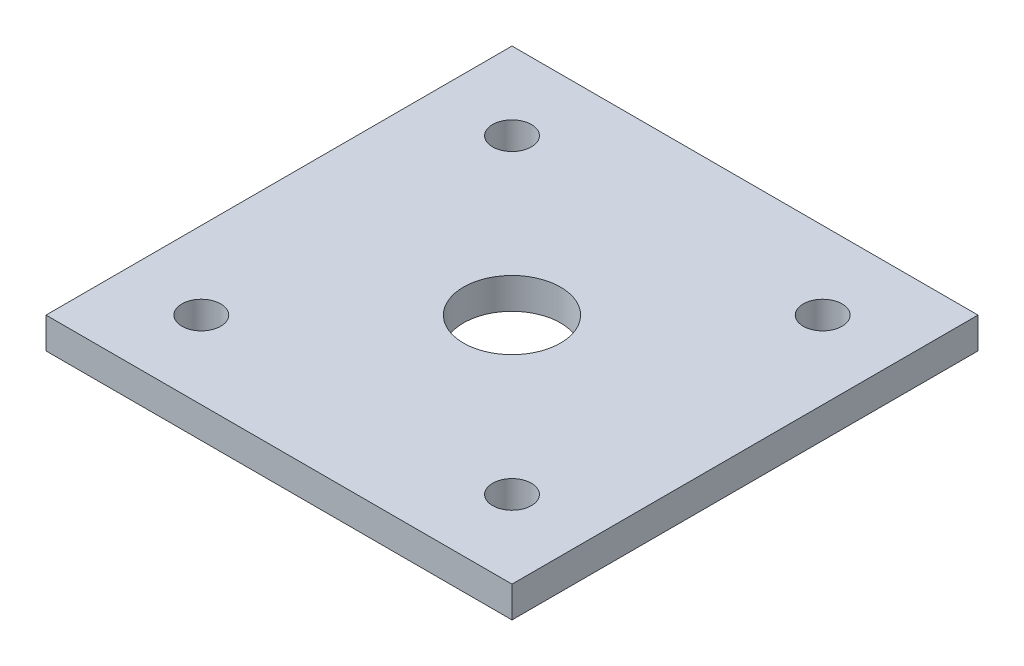
ISO-10303-21;
HEADER;
FILE_DESCRIPTION(('STEP AP214'),'2;1');
FILE_NAME('part.step','',(''),(''),'','','');
FILE_SCHEMA(('AUTOMOTIVE_DESIGN { 1 0 10303 214 1 1 1 1 }'));
ENDSEC;
DATA;
#1=APPLICATION_CONTEXT('core data for automotive mechanical design processes');
#2=APPLICATION_PROTOCOL_DEFINITION('international standard','automotive_design',2000,#1);
#3=PRODUCT_CONTEXT('',#1,'mechanical');
#4=PRODUCT('Part','Part','',(#3));
#5=PRODUCT_RELATED_PRODUCT_CATEGORY('part','',(#4));
#6=PRODUCT_DEFINITION_FORMATION('','',#4);
#7=PRODUCT_DEFINITION_CONTEXT('part definition',#1,'design');
#8=PRODUCT_DEFINITION('design','',#6,#7);
#9=PRODUCT_DEFINITION_SHAPE('','',#8);
#10=(LENGTH_UNIT() NAMED_UNIT(*) SI_UNIT(.MILLI.,.METRE.));
#11=(NAMED_UNIT(*) PLANE_ANGLE_UNIT() SI_UNIT($,.RADIAN.));
#12=(NAMED_UNIT(*) SI_UNIT($,.STERADIAN.) SOLID_ANGLE_UNIT());
#13=UNCERTAINTY_MEASURE_WITH_UNIT(LENGTH_MEASURE(1.E-05),#10,'distance_accuracy_value','');
#14=(GEOMETRIC_REPRESENTATION_CONTEXT(3) GLOBAL_UNCERTAINTY_ASSIGNED_CONTEXT((#13)) GLOBAL_UNIT_ASSIGNED_CONTEXT((#10,
#11,#12)) REPRESENTATION_CONTEXT('',''));
#15=CARTESIAN_POINT('',(0.,0.,0.));
#16=DIRECTION('',(0.,0.,1.));
#17=DIRECTION('',(1.,0.,0.));
#18=AXIS2_PLACEMENT_3D('',#15,#16,#17);
#19=CARTESIAN_POINT('',(60.,8.,-60.));
#20=DIRECTION('',(-1.,0.,0.));
#21=DIRECTION('',(0.,0.,1.));
#22=AXIS2_PLACEMENT_3D('',#19,#20,#21);
#23=PLANE('',#22);
#24=DIRECTION('',(0.,0.,-1.));
#25=VECTOR('',#24,1.);
#26=CARTESIAN_POINT('',(60.,0.,-60.));
#27=LINE('',#26,#25);
#28=CARTESIAN_POINT('',(60.,0.,60.));
#29=VERTEX_POINT('',#28);
#30=CARTESIAN_POINT('',(60.,0.,-60.));
#31=VERTEX_POINT('',#30);
#32=EDGE_CURVE('E111',#29,#31,#27,.T.);
#33=ORIENTED_EDGE('',*,*,#32,.T.);
#34=DIRECTION('',(0.,-1.,0.));
#35=VECTOR('',#34,1.);
#36=CARTESIAN_POINT('',(60.,8.,-60.));
#37=LINE('',#36,#35);
#38=CARTESIAN_POINT('',(60.,8.,-60.));
#39=VERTEX_POINT('',#38);
#40=EDGE_CURVE('E11',#39,#31,#37,.T.);
#41=ORIENTED_EDGE('',*,*,#40,.F.);
#42=DIRECTION('',(0.,0.,-1.));
#43=VECTOR('',#42,1.);
#44=CARTESIAN_POINT('',(60.,8.,-60.));
#45=LINE('',#44,#43);
#46=CARTESIAN_POINT('',(60.,8.,60.));
#47=VERTEX_POINT('',#46);
#48=EDGE_CURVE('E94',#47,#39,#45,.T.);
#49=ORIENTED_EDGE('',*,*,#48,.F.);
#50=DIRECTION('',(0.,-1.,0.));
#51=VECTOR('',#50,1.);
#52=CARTESIAN_POINT('',(60.,8.,60.));
#53=LINE('',#52,#51);
#54=EDGE_CURVE('E107',#47,#29,#53,.T.);
#55=ORIENTED_EDGE('',*,*,#54,.T.);
#56=EDGE_LOOP('',(#33,#41,#49,#55));
#57=FACE_BOUND('',#56,.T.);
#58=ADVANCED_FACE('F40',(#57),#23,.F.);
#59=CARTESIAN_POINT('',(-60.,8.,-60.));
#60=DIRECTION('',(0.,0.,1.));
#61=DIRECTION('',(1.,0.,0.));
#62=AXIS2_PLACEMENT_3D('',#59,#60,#61);
#63=PLANE('',#62);
#64=DIRECTION('',(-1.,0.,0.));
#65=VECTOR('',#64,1.);
#66=CARTESIAN_POINT('',(-60.,0.,-60.));
#67=LINE('',#66,#65);
#68=CARTESIAN_POINT('',(-60.,0.,-60.));
#69=VERTEX_POINT('',#68);
#70=EDGE_CURVE('E99',#31,#69,#67,.T.);
#71=ORIENTED_EDGE('',*,*,#70,.T.);
#72=DIRECTION('',(0.,-1.,0.));
#73=VECTOR('',#72,1.);
#74=CARTESIAN_POINT('',(-60.,8.,-60.));
#75=LINE('',#74,#73);
#76=CARTESIAN_POINT('',(-60.,8.,-60.));
#77=VERTEX_POINT('',#76);
#78=EDGE_CURVE('E50',#77,#69,#75,.T.);
#79=ORIENTED_EDGE('',*,*,#78,.F.);
#80=DIRECTION('',(-1.,0.,0.));
#81=VECTOR('',#80,1.);
#82=CARTESIAN_POINT('',(-60.,8.,-60.));
#83=LINE('',#82,#81);
#84=EDGE_CURVE('E89',#39,#77,#83,.T.);
#85=ORIENTED_EDGE('',*,*,#84,.F.);
#86=ORIENTED_EDGE('',*,*,#40,.T.);
#87=EDGE_LOOP('',(#71,#79,#85,#86));
#88=FACE_BOUND('',#87,.T.);
#89=ADVANCED_FACE('F98',(#88),#63,.F.);
#90=CARTESIAN_POINT('',(-60.,8.,-60.));
#91=DIRECTION('',(1.,0.,0.));
#92=DIRECTION('',(0.,0.,-1.));
#93=AXIS2_PLACEMENT_3D('',#90,#91,#92);
#94=PLANE('',#93);
#95=DIRECTION('',(0.,0.,1.));
#96=VECTOR('',#95,1.);
#97=CARTESIAN_POINT('',(-60.,0.,-60.));
#98=LINE('',#97,#96);
#99=CARTESIAN_POINT('',(-60.,0.,60.));
#100=VERTEX_POINT('',#99);
#101=EDGE_CURVE('E76',#69,#100,#98,.T.);
#102=ORIENTED_EDGE('',*,*,#101,.T.);
#103=DIRECTION('',(0.,-1.,0.));
#104=VECTOR('',#103,1.);
#105=CARTESIAN_POINT('',(-60.,8.,60.));
#106=LINE('',#105,#104);
#107=CARTESIAN_POINT('',(-60.,8.,60.));
#108=VERTEX_POINT('',#107);
#109=EDGE_CURVE('E101',#108,#100,#106,.T.);
#110=ORIENTED_EDGE('',*,*,#109,.F.);
#111=DIRECTION('',(0.,0.,1.));
#112=VECTOR('',#111,1.);
#113=CARTESIAN_POINT('',(-60.,8.,-60.));
#114=LINE('',#113,#112);
#115=EDGE_CURVE('E92',#77,#108,#114,.T.);
#116=ORIENTED_EDGE('',*,*,#115,.F.);
#117=ORIENTED_EDGE('',*,*,#78,.T.);
#118=EDGE_LOOP('',(#102,#110,#116,#117));
#119=FACE_BOUND('',#118,.T.);
#120=ADVANCED_FACE('F103',(#119),#94,.F.);
#121=CARTESIAN_POINT('',(-60.,8.,60.));
#122=DIRECTION('',(0.,0.,-1.));
#123=DIRECTION('',(-1.,0.,0.));
#124=AXIS2_PLACEMENT_3D('',#121,#122,#123);
#125=PLANE('',#124);
#126=DIRECTION('',(1.,0.,0.));
#127=VECTOR('',#126,1.);
#128=CARTESIAN_POINT('',(-60.,0.,60.));
#129=LINE('',#128,#127);
#130=EDGE_CURVE('E82',#100,#29,#129,.T.);
#131=ORIENTED_EDGE('',*,*,#130,.T.);
#132=ORIENTED_EDGE('',*,*,#54,.F.);
#133=DIRECTION('',(1.,0.,0.));
#134=VECTOR('',#133,1.);
#135=CARTESIAN_POINT('',(-60.,8.,60.));
#136=LINE('',#135,#134);
#137=EDGE_CURVE('E59',#108,#47,#136,.T.);
#138=ORIENTED_EDGE('',*,*,#137,.F.);
#139=ORIENTED_EDGE('',*,*,#109,.T.);
#140=EDGE_LOOP('',(#131,#132,#138,#139));
#141=FACE_BOUND('',#140,.T.);
#142=ADVANCED_FACE('F176',(#141),#125,.F.);
#143=CARTESIAN_POINT('',(0.,8.,0.));
#144=DIRECTION('',(0.,1.,0.));
#145=DIRECTION('',(0.,0.,1.));
#146=AXIS2_PLACEMENT_3D('',#143,#144,#145);
#147=PLANE('',#146);
#148=CARTESIAN_POINT('',(-39.9999999999992,8.,40.));
#149=DIRECTION('',(0.,1.,0.));
#150=DIRECTION('',(0.,0.,1.));
#151=AXIS2_PLACEMENT_3D('',#148,#149,#150);
#152=CIRCLE('',#151,5.);
#153=CARTESIAN_POINT('',(-39.9999999999992,8.,45.));
#154=VERTEX_POINT('',#153);
#155=EDGE_CURVE('E158',#154,#154,#152,.T.);
#156=ORIENTED_EDGE('',*,*,#155,.F.);
#157=EDGE_LOOP('',(#156));
#158=FACE_BOUND('',#157,.T.);
#159=CARTESIAN_POINT('',(40.0000000000008,8.,40.));
#160=DIRECTION('',(0.,1.,0.));
#161=DIRECTION('',(0.,0.,1.));
#162=AXIS2_PLACEMENT_3D('',#159,#160,#161);
#163=CIRCLE('',#162,5.);
#164=CARTESIAN_POINT('',(40.0000000000008,8.,45.));
#165=VERTEX_POINT('',#164);
#166=EDGE_CURVE('E162',#165,#165,#163,.T.);
#167=ORIENTED_EDGE('',*,*,#166,.F.);
#168=EDGE_LOOP('',(#167));
#169=FACE_BOUND('',#168,.T.);
#170=CARTESIAN_POINT('',(40.,8.,-40.));
#171=DIRECTION('',(0.,1.,0.));
#172=DIRECTION('',(0.,0.,1.));
#173=AXIS2_PLACEMENT_3D('',#170,#171,#172);
#174=CIRCLE('',#173,5.);
#175=CARTESIAN_POINT('',(40.,8.,-35.));
#176=VERTEX_POINT('',#175);
#177=EDGE_CURVE('E157',#176,#176,#174,.T.);
#178=ORIENTED_EDGE('',*,*,#177,.F.);
#179=EDGE_LOOP('',(#178));
#180=FACE_BOUND('',#179,.T.);
#181=CARTESIAN_POINT('',(-40.,8.,-40.));
#182=DIRECTION('',(0.,1.,0.));
#183=DIRECTION('',(0.,0.,1.));
#184=AXIS2_PLACEMENT_3D('',#181,#182,#183);
#185=CIRCLE('',#184,5.);
#186=CARTESIAN_POINT('',(-40.,8.,-35.));
#187=VERTEX_POINT('',#186);
#188=EDGE_CURVE('E131',#187,#187,#185,.T.);
#189=ORIENTED_EDGE('',*,*,#188,.F.);
#190=EDGE_LOOP('',(#189));
#191=FACE_BOUND('',#190,.T.);
#192=CARTESIAN_POINT('',(0.,8.,0.));
#193=DIRECTION('',(0.,1.,0.));
#194=DIRECTION('',(0.,0.,1.));
#195=AXIS2_PLACEMENT_3D('',#192,#193,#194);
#196=CIRCLE('',#195,12.5);
#197=CARTESIAN_POINT('',(0.,8.,12.5));
#198=VERTEX_POINT('',#197);
#199=EDGE_CURVE('E141',#198,#198,#196,.T.);
#200=ORIENTED_EDGE('',*,*,#199,.F.);
#201=EDGE_LOOP('',(#200));
#202=FACE_BOUND('',#201,.T.);
#203=ORIENTED_EDGE('',*,*,#48,.T.);
#204=ORIENTED_EDGE('',*,*,#84,.T.);
#205=ORIENTED_EDGE('',*,*,#115,.T.);
#206=ORIENTED_EDGE('',*,*,#137,.T.);
#207=EDGE_LOOP('',(#203,#204,#205,#206));
#208=FACE_BOUND('',#207,.T.);
#209=ADVANCED_FACE('F90',(#158,#169,#180,#191,#202,#208),#147,.T.);
#210=CARTESIAN_POINT('',(0.,0.,0.));
#211=DIRECTION('',(0.,1.,0.));
#212=DIRECTION('',(0.,0.,1.));
#213=AXIS2_PLACEMENT_3D('',#210,#211,#212);
#214=PLANE('',#213);
#215=CARTESIAN_POINT('',(-39.9999999999992,0.,40.));
#216=DIRECTION('',(0.,1.,0.));
#217=DIRECTION('',(0.,0.,1.));
#218=AXIS2_PLACEMENT_3D('',#215,#216,#217);
#219=CIRCLE('',#218,5.);
#220=CARTESIAN_POINT('',(-39.9999999999992,0.,45.));
#221=VERTEX_POINT('',#220);
#222=EDGE_CURVE('E43',#221,#221,#219,.T.);
#223=ORIENTED_EDGE('',*,*,#222,.T.);
#224=EDGE_LOOP('',(#223));
#225=FACE_BOUND('',#224,.T.);
#226=CARTESIAN_POINT('',(40.0000000000008,0.,40.));
#227=DIRECTION('',(0.,1.,0.));
#228=DIRECTION('',(0.,0.,1.));
#229=AXIS2_PLACEMENT_3D('',#226,#227,#228);
#230=CIRCLE('',#229,5.);
#231=CARTESIAN_POINT('',(40.0000000000008,0.,45.));
#232=VERTEX_POINT('',#231);
#233=EDGE_CURVE('E134',#232,#232,#230,.T.);
#234=ORIENTED_EDGE('',*,*,#233,.T.);
#235=EDGE_LOOP('',(#234));
#236=FACE_BOUND('',#235,.T.);
#237=CARTESIAN_POINT('',(40.,0.,-40.));
#238=DIRECTION('',(0.,1.,0.));
#239=DIRECTION('',(0.,0.,1.));
#240=AXIS2_PLACEMENT_3D('',#237,#238,#239);
#241=CIRCLE('',#240,5.);
#242=CARTESIAN_POINT('',(40.,0.,-35.));
#243=VERTEX_POINT('',#242);
#244=EDGE_CURVE('E130',#243,#243,#241,.T.);
#245=ORIENTED_EDGE('',*,*,#244,.T.);
#246=EDGE_LOOP('',(#245));
#247=FACE_BOUND('',#246,.T.);
#248=CARTESIAN_POINT('',(-40.,0.,-40.));
#249=DIRECTION('',(0.,1.,0.));
#250=DIRECTION('',(0.,0.,1.));
#251=AXIS2_PLACEMENT_3D('',#248,#249,#250);
#252=CIRCLE('',#251,5.);
#253=CARTESIAN_POINT('',(-40.,0.,-35.));
#254=VERTEX_POINT('',#253);
#255=EDGE_CURVE('E126',#254,#254,#252,.T.);
#256=ORIENTED_EDGE('',*,*,#255,.T.);
#257=EDGE_LOOP('',(#256));
#258=FACE_BOUND('',#257,.T.);
#259=CARTESIAN_POINT('',(0.,0.,0.));
#260=DIRECTION('',(0.,1.,0.));
#261=DIRECTION('',(0.,0.,1.));
#262=AXIS2_PLACEMENT_3D('',#259,#260,#261);
#263=CIRCLE('',#262,12.5);
#264=CARTESIAN_POINT('',(0.,0.,12.5));
#265=VERTEX_POINT('',#264);
#266=EDGE_CURVE('E115',#265,#265,#263,.T.);
#267=ORIENTED_EDGE('',*,*,#266,.T.);
#268=EDGE_LOOP('',(#267));
#269=FACE_BOUND('',#268,.T.);
#270=ORIENTED_EDGE('',*,*,#32,.F.);
#271=ORIENTED_EDGE('',*,*,#130,.F.);
#272=ORIENTED_EDGE('',*,*,#101,.F.);
#273=ORIENTED_EDGE('',*,*,#70,.F.);
#274=EDGE_LOOP('',(#270,#271,#272,#273));
#275=FACE_BOUND('',#274,.T.);
#276=ADVANCED_FACE('F175',(#225,#236,#247,#258,#269,#275),#214,.F.);
#277=CARTESIAN_POINT('',(0.,0.,0.));
#278=DIRECTION('',(0.,1.,0.));
#279=DIRECTION('',(0.,0.,1.));
#280=AXIS2_PLACEMENT_3D('',#277,#278,#279);
#281=CYLINDRICAL_SURFACE('',#280,12.5);
#282=ORIENTED_EDGE('',*,*,#266,.F.);
#283=EDGE_LOOP('',(#282));
#284=FACE_BOUND('',#283,.T.);
#285=ORIENTED_EDGE('',*,*,#199,.T.);
#286=EDGE_LOOP('',(#285));
#287=FACE_BOUND('',#286,.T.);
#288=ADVANCED_FACE('F185',(#284,#287),#281,.F.);
#289=CARTESIAN_POINT('',(-40.,-2.,-40.));
#290=DIRECTION('',(0.,1.,0.));
#291=DIRECTION('',(0.,0.,1.));
#292=AXIS2_PLACEMENT_3D('',#289,#290,#291);
#293=CYLINDRICAL_SURFACE('',#292,5.);
#294=ORIENTED_EDGE('',*,*,#188,.T.);
#295=EDGE_LOOP('',(#294));
#296=FACE_BOUND('',#295,.T.);
#297=ORIENTED_EDGE('',*,*,#255,.F.);
#298=EDGE_LOOP('',(#297));
#299=FACE_BOUND('',#298,.T.);
#300=ADVANCED_FACE('F182',(#296,#299),#293,.F.);
#301=CARTESIAN_POINT('',(40.,-2.,-40.));
#302=DIRECTION('',(0.,1.,0.));
#303=DIRECTION('',(0.,0.,1.));
#304=AXIS2_PLACEMENT_3D('',#301,#302,#303);
#305=CYLINDRICAL_SURFACE('',#304,5.);
#306=ORIENTED_EDGE('',*,*,#177,.T.);
#307=EDGE_LOOP('',(#306));
#308=FACE_BOUND('',#307,.T.);
#309=ORIENTED_EDGE('',*,*,#244,.F.);
#310=EDGE_LOOP('',(#309));
#311=FACE_BOUND('',#310,.T.);
#312=ADVANCED_FACE('F170',(#308,#311),#305,.F.);
#313=CARTESIAN_POINT('',(40.0000000000008,-2.,40.));
#314=DIRECTION('',(0.,1.,0.));
#315=DIRECTION('',(0.,0.,1.));
#316=AXIS2_PLACEMENT_3D('',#313,#314,#315);
#317=CYLINDRICAL_SURFACE('',#316,5.);
#318=ORIENTED_EDGE('',*,*,#166,.T.);
#319=EDGE_LOOP('',(#318));
#320=FACE_BOUND('',#319,.T.);
#321=ORIENTED_EDGE('',*,*,#233,.F.);
#322=EDGE_LOOP('',(#321));
#323=FACE_BOUND('',#322,.T.);
#324=ADVANCED_FACE('F252',(#320,#323),#317,.F.);
#325=CARTESIAN_POINT('',(-39.9999999999992,-2.,40.));
#326=DIRECTION('',(0.,1.,0.));
#327=DIRECTION('',(0.,0.,1.));
#328=AXIS2_PLACEMENT_3D('',#325,#326,#327);
#329=CYLINDRICAL_SURFACE('',#328,5.);
#330=ORIENTED_EDGE('',*,*,#155,.T.);
#331=EDGE_LOOP('',(#330));
#332=FACE_BOUND('',#331,.T.);
#333=ORIENTED_EDGE('',*,*,#222,.F.);
#334=EDGE_LOOP('',(#333));
#335=FACE_BOUND('',#334,.T.);
#336=ADVANCED_FACE('F261',(#332,#335),#329,.F.);
#337=CLOSED_SHELL('',(#58,#89,#120,#142,#209,#276,#288,#300,#312,#324,#336));
#338=MANIFOLD_SOLID_BREP('B2',#337);
#339=ADVANCED_BREP_SHAPE_REPRESENTATION('',(#18,#338),#14);
#340=SHAPE_DEFINITION_REPRESENTATION(#9,#339);
ENDSEC;
END-ISO-10303-21;
